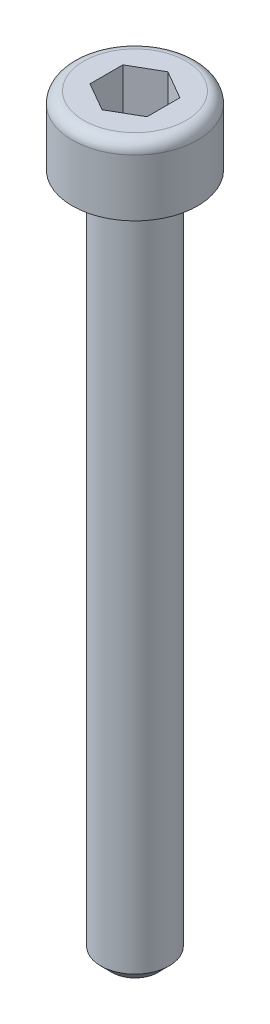
ISO-10303-21;
HEADER;
FILE_DESCRIPTION(('STEP AP214'),'2;1');
FILE_NAME('part.step','',(''),(''),'','','');
FILE_SCHEMA(('AUTOMOTIVE_DESIGN { 1 0 10303 214 1 1 1 1 }'));
ENDSEC;
DATA;
#1=APPLICATION_CONTEXT('core data for automotive mechanical design processes');
#2=APPLICATION_PROTOCOL_DEFINITION('international standard','automotive_design',2000,#1);
#3=PRODUCT_CONTEXT('',#1,'mechanical');
#4=PRODUCT('Part','Part','',(#3));
#5=PRODUCT_RELATED_PRODUCT_CATEGORY('part','',(#4));
#6=PRODUCT_DEFINITION_FORMATION('','',#4);
#7=PRODUCT_DEFINITION_CONTEXT('part definition',#1,'design');
#8=PRODUCT_DEFINITION('design','',#6,#7);
#9=PRODUCT_DEFINITION_SHAPE('','',#8);
#10=(LENGTH_UNIT() NAMED_UNIT(*) SI_UNIT(.MILLI.,.METRE.));
#11=(NAMED_UNIT(*) PLANE_ANGLE_UNIT() SI_UNIT($,.RADIAN.));
#12=(NAMED_UNIT(*) SI_UNIT($,.STERADIAN.) SOLID_ANGLE_UNIT());
#13=UNCERTAINTY_MEASURE_WITH_UNIT(LENGTH_MEASURE(1.E-05),#10,'distance_accuracy_value','');
#14=(GEOMETRIC_REPRESENTATION_CONTEXT(3) GLOBAL_UNCERTAINTY_ASSIGNED_CONTEXT((#13)) GLOBAL_UNIT_ASSIGNED_CONTEXT((#10,
#11,#12)) REPRESENTATION_CONTEXT('',''));
#15=CARTESIAN_POINT('',(0.,0.,0.));
#16=DIRECTION('',(0.,0.,1.));
#17=DIRECTION('',(1.,0.,0.));
#18=AXIS2_PLACEMENT_3D('',#15,#16,#17);
#19=CARTESIAN_POINT('',(0.,0.,0.));
#20=DIRECTION('',(0.,-1.,0.));
#21=DIRECTION('',(0.,0.,-1.));
#22=AXIS2_PLACEMENT_3D('',#19,#20,#21);
#23=PLANE('',#22);
#24=CARTESIAN_POINT('',(0.,0.,0.));
#25=DIRECTION('',(0.,-1.,0.));
#26=DIRECTION('',(0.,0.,-1.));
#27=AXIS2_PLACEMENT_3D('',#24,#25,#26);
#28=CIRCLE('',#27,2.25);
#29=CARTESIAN_POINT('',(0.,0.,-2.25));
#30=VERTEX_POINT('',#29);
#31=EDGE_CURVE('E42',#30,#30,#28,.F.);
#32=ORIENTED_EDGE('',*,*,#31,.T.);
#33=EDGE_LOOP('',(#32));
#34=FACE_BOUND('',#33,.T.);
#35=DIRECTION('',(-0.866025403784439,0.,-0.5));
#36=VECTOR('',#35,1.);
#37=CARTESIAN_POINT('',(1.25,0.,-0.721687836487032));
#38=LINE('',#37,#36);
#39=CARTESIAN_POINT('',(1.25,0.,-0.721687836487032));
#40=VERTEX_POINT('',#39);
#41=CARTESIAN_POINT('',(0.,0.,-1.44337567297406));
#42=VERTEX_POINT('',#41);
#43=EDGE_CURVE('E123',#40,#42,#38,.T.);
#44=ORIENTED_EDGE('',*,*,#43,.F.);
#45=DIRECTION('',(0.,0.,-1.));
#46=VECTOR('',#45,1.);
#47=CARTESIAN_POINT('',(1.25,0.,0.721687836487033));
#48=LINE('',#47,#46);
#49=CARTESIAN_POINT('',(1.25,0.,0.721687836487033));
#50=VERTEX_POINT('',#49);
#51=EDGE_CURVE('E49',#50,#40,#48,.T.);
#52=ORIENTED_EDGE('',*,*,#51,.F.);
#53=DIRECTION('',(0.866025403784439,0.,-0.5));
#54=VECTOR('',#53,1.);
#55=CARTESIAN_POINT('',(0.,0.,1.44337567297406));
#56=LINE('',#55,#54);
#57=CARTESIAN_POINT('',(0.,0.,1.44337567297406));
#58=VERTEX_POINT('',#57);
#59=EDGE_CURVE('E132',#58,#50,#56,.T.);
#60=ORIENTED_EDGE('',*,*,#59,.F.);
#61=DIRECTION('',(0.866025403784439,0.,0.5));
#62=VECTOR('',#61,1.);
#63=CARTESIAN_POINT('',(-1.25,0.,0.721687836487031));
#64=LINE('',#63,#62);
#65=CARTESIAN_POINT('',(-1.25,0.,0.721687836487031));
#66=VERTEX_POINT('',#65);
#67=EDGE_CURVE('E130',#66,#58,#64,.T.);
#68=ORIENTED_EDGE('',*,*,#67,.F.);
#69=DIRECTION('',(0.,0.,1.));
#70=VECTOR('',#69,1.);
#71=CARTESIAN_POINT('',(-1.25,0.,-0.721687836487033));
#72=LINE('',#71,#70);
#73=CARTESIAN_POINT('',(-1.25,0.,-0.721687836487033));
#74=VERTEX_POINT('',#73);
#75=EDGE_CURVE('E97',#74,#66,#72,.T.);
#76=ORIENTED_EDGE('',*,*,#75,.F.);
#77=DIRECTION('',(-0.866025403784439,0.,0.5));
#78=VECTOR('',#77,1.);
#79=CARTESIAN_POINT('',(0.,0.,-1.44337567297406));
#80=LINE('',#79,#78);
#81=EDGE_CURVE('E126',#42,#74,#80,.T.);
#82=ORIENTED_EDGE('',*,*,#81,.F.);
#83=EDGE_LOOP('',(#44,#52,#60,#68,#76,#82));
#84=FACE_BOUND('',#83,.T.);
#85=ADVANCED_FACE('F34',(#34,#84),#23,.F.);
#86=CARTESIAN_POINT('',(0.,0.,0.));
#87=DIRECTION('',(0.,1.,0.));
#88=DIRECTION('',(0.,0.,1.));
#89=AXIS2_PLACEMENT_3D('',#86,#87,#88);
#90=CYLINDRICAL_SURFACE('',#89,2.75);
#91=CARTESIAN_POINT('',(0.,-0.5,0.));
#92=DIRECTION('',(0.,-1.,0.));
#93=DIRECTION('',(0.,0.,-1.));
#94=AXIS2_PLACEMENT_3D('',#91,#92,#93);
#95=CIRCLE('',#94,2.75);
#96=CARTESIAN_POINT('',(0.,-0.5,-2.75));
#97=VERTEX_POINT('',#96);
#98=EDGE_CURVE('E11',#97,#97,#95,.T.);
#99=ORIENTED_EDGE('',*,*,#98,.T.);
#100=EDGE_LOOP('',(#99));
#101=FACE_BOUND('',#100,.T.);
#102=CARTESIAN_POINT('',(0.,-3.,0.));
#103=DIRECTION('',(0.,1.,0.));
#104=DIRECTION('',(0.,0.,1.));
#105=AXIS2_PLACEMENT_3D('',#102,#103,#104);
#106=CIRCLE('',#105,2.75);
#107=CARTESIAN_POINT('',(0.,-3.,2.75));
#108=VERTEX_POINT('',#107);
#109=EDGE_CURVE('E144',#108,#108,#106,.T.);
#110=ORIENTED_EDGE('',*,*,#109,.T.);
#111=EDGE_LOOP('',(#110));
#112=FACE_BOUND('',#111,.T.);
#113=ADVANCED_FACE('F166',(#101,#112),#90,.T.);
#114=CARTESIAN_POINT('',(2.75,-3.,0.));
#115=DIRECTION('',(0.,1.,0.));
#116=DIRECTION('',(0.,0.,1.));
#117=AXIS2_PLACEMENT_3D('',#114,#115,#116);
#118=PLANE('',#117);
#119=ORIENTED_EDGE('',*,*,#109,.F.);
#120=EDGE_LOOP('',(#119));
#121=FACE_BOUND('',#120,.T.);
#122=CARTESIAN_POINT('',(0.,-3.,0.));
#123=DIRECTION('',(0.,1.,0.));
#124=DIRECTION('',(0.,0.,1.));
#125=AXIS2_PLACEMENT_3D('',#122,#123,#124);
#126=CIRCLE('',#125,1.5);
#127=CARTESIAN_POINT('',(0.,-3.,1.5));
#128=VERTEX_POINT('',#127);
#129=EDGE_CURVE('E136',#128,#128,#126,.T.);
#130=ORIENTED_EDGE('',*,*,#129,.T.);
#131=EDGE_LOOP('',(#130));
#132=FACE_BOUND('',#131,.T.);
#133=ADVANCED_FACE('F171',(#121,#132),#118,.F.);
#134=CARTESIAN_POINT('',(0.,0.,0.));
#135=DIRECTION('',(0.,1.,0.));
#136=DIRECTION('',(0.,0.,1.));
#137=AXIS2_PLACEMENT_3D('',#134,#135,#136);
#138=CYLINDRICAL_SURFACE('',#137,1.5);
#139=CARTESIAN_POINT('',(0.,-32.5,0.));
#140=DIRECTION('',(0.,1.,0.));
#141=DIRECTION('',(0.,0.,1.));
#142=AXIS2_PLACEMENT_3D('',#139,#140,#141);
#143=CIRCLE('',#142,1.5);
#144=CARTESIAN_POINT('',(0.,-32.5,1.5));
#145=VERTEX_POINT('',#144);
#146=EDGE_CURVE('E147',#145,#145,#143,.T.);
#147=ORIENTED_EDGE('',*,*,#146,.T.);
#148=EDGE_LOOP('',(#147));
#149=FACE_BOUND('',#148,.T.);
#150=ORIENTED_EDGE('',*,*,#129,.F.);
#151=EDGE_LOOP('',(#150));
#152=FACE_BOUND('',#151,.T.);
#153=ADVANCED_FACE('F177',(#149,#152),#138,.T.);
#154=CARTESIAN_POINT('',(1.5,-33.,0.));
#155=DIRECTION('',(0.,1.,0.));
#156=DIRECTION('',(0.,0.,1.));
#157=AXIS2_PLACEMENT_3D('',#154,#155,#156);
#158=PLANE('',#157);
#159=CARTESIAN_POINT('',(0.,-33.,0.));
#160=DIRECTION('',(0.,1.,0.));
#161=DIRECTION('',(0.,0.,1.));
#162=AXIS2_PLACEMENT_3D('',#159,#160,#161);
#163=CIRCLE('',#162,1.);
#164=CARTESIAN_POINT('',(0.,-33.,1.));
#165=VERTEX_POINT('',#164);
#166=EDGE_CURVE('E150',#165,#165,#163,.F.);
#167=ORIENTED_EDGE('',*,*,#166,.T.);
#168=EDGE_LOOP('',(#167));
#169=FACE_BOUND('',#168,.T.);
#170=ADVANCED_FACE('F181',(#169),#158,.F.);
#171=CARTESIAN_POINT('',(1.25,-2.,0.721687836487033));
#172=DIRECTION('',(1.,0.,0.));
#173=DIRECTION('',(0.,0.,-1.));
#174=AXIS2_PLACEMENT_3D('',#171,#172,#173);
#175=PLANE('',#174);
#176=ORIENTED_EDGE('',*,*,#51,.T.);
#177=DIRECTION('',(0.,1.,0.));
#178=VECTOR('',#177,1.);
#179=CARTESIAN_POINT('',(1.25,-2.,-0.721687836487032));
#180=LINE('',#179,#178);
#181=CARTESIAN_POINT('',(1.25,-2.,-0.721687836487032));
#182=VERTEX_POINT('',#181);
#183=EDGE_CURVE('E79',#182,#40,#180,.T.);
#184=ORIENTED_EDGE('',*,*,#183,.F.);
#185=DIRECTION('',(0.,0.,-1.));
#186=VECTOR('',#185,1.);
#187=CARTESIAN_POINT('',(1.25,-2.,0.721687836487033));
#188=LINE('',#187,#186);
#189=CARTESIAN_POINT('',(1.25,-2.,0.721687836487033));
#190=VERTEX_POINT('',#189);
#191=EDGE_CURVE('E134',#190,#182,#188,.T.);
#192=ORIENTED_EDGE('',*,*,#191,.F.);
#193=DIRECTION('',(0.,1.,0.));
#194=VECTOR('',#193,1.);
#195=CARTESIAN_POINT('',(1.25,-2.,0.721687836487033));
#196=LINE('',#195,#194);
#197=EDGE_CURVE('E57',#190,#50,#196,.T.);
#198=ORIENTED_EDGE('',*,*,#197,.T.);
#199=EDGE_LOOP('',(#176,#184,#192,#198));
#200=FACE_BOUND('',#199,.T.);
#201=ADVANCED_FACE('F185',(#200),#175,.F.);
#202=CARTESIAN_POINT('',(0.,-2.,1.44337567297406));
#203=DIRECTION('',(0.5,0.,0.866025403784439));
#204=DIRECTION('',(0.866025403784439,0.,-0.5));
#205=AXIS2_PLACEMENT_3D('',#202,#203,#204);
#206=PLANE('',#205);
#207=ORIENTED_EDGE('',*,*,#59,.T.);
#208=ORIENTED_EDGE('',*,*,#197,.F.);
#209=DIRECTION('',(0.866025403784439,0.,-0.5));
#210=VECTOR('',#209,1.);
#211=CARTESIAN_POINT('',(0.,-2.,1.44337567297406));
#212=LINE('',#211,#210);
#213=CARTESIAN_POINT('',(0.,-2.,1.44337567297406));
#214=VERTEX_POINT('',#213);
#215=EDGE_CURVE('E109',#214,#190,#212,.T.);
#216=ORIENTED_EDGE('',*,*,#215,.F.);
#217=DIRECTION('',(0.,1.,0.));
#218=VECTOR('',#217,1.);
#219=CARTESIAN_POINT('',(0.,-2.,1.44337567297406));
#220=LINE('',#219,#218);
#221=EDGE_CURVE('E101',#214,#58,#220,.T.);
#222=ORIENTED_EDGE('',*,*,#221,.T.);
#223=EDGE_LOOP('',(#207,#208,#216,#222));
#224=FACE_BOUND('',#223,.T.);
#225=ADVANCED_FACE('F189',(#224),#206,.F.);
#226=CARTESIAN_POINT('',(-1.25,-2.,0.721687836487031));
#227=DIRECTION('',(-0.5,0.,0.866025403784439));
#228=DIRECTION('',(0.866025403784439,0.,0.5));
#229=AXIS2_PLACEMENT_3D('',#226,#227,#228);
#230=PLANE('',#229);
#231=ORIENTED_EDGE('',*,*,#67,.T.);
#232=ORIENTED_EDGE('',*,*,#221,.F.);
#233=DIRECTION('',(0.866025403784439,0.,0.5));
#234=VECTOR('',#233,1.);
#235=CARTESIAN_POINT('',(-1.25,-2.,0.721687836487031));
#236=LINE('',#235,#234);
#237=CARTESIAN_POINT('',(-1.25,-2.,0.721687836487031));
#238=VERTEX_POINT('',#237);
#239=EDGE_CURVE('E105',#238,#214,#236,.T.);
#240=ORIENTED_EDGE('',*,*,#239,.F.);
#241=DIRECTION('',(0.,1.,0.));
#242=VECTOR('',#241,1.);
#243=CARTESIAN_POINT('',(-1.25,-2.,0.721687836487031));
#244=LINE('',#243,#242);
#245=EDGE_CURVE('E90',#238,#66,#244,.T.);
#246=ORIENTED_EDGE('',*,*,#245,.T.);
#247=EDGE_LOOP('',(#231,#232,#240,#246));
#248=FACE_BOUND('',#247,.T.);
#249=ADVANCED_FACE('F106',(#248),#230,.F.);
#250=CARTESIAN_POINT('',(-1.25,-2.,-0.721687836487033));
#251=DIRECTION('',(-1.,0.,0.));
#252=DIRECTION('',(0.,0.,1.));
#253=AXIS2_PLACEMENT_3D('',#250,#251,#252);
#254=PLANE('',#253);
#255=ORIENTED_EDGE('',*,*,#75,.T.);
#256=ORIENTED_EDGE('',*,*,#245,.F.);
#257=DIRECTION('',(0.,0.,1.));
#258=VECTOR('',#257,1.);
#259=CARTESIAN_POINT('',(-1.25,-2.,-0.721687836487033));
#260=LINE('',#259,#258);
#261=CARTESIAN_POINT('',(-1.25,-2.,-0.721687836487033));
#262=VERTEX_POINT('',#261);
#263=EDGE_CURVE('E94',#262,#238,#260,.T.);
#264=ORIENTED_EDGE('',*,*,#263,.F.);
#265=DIRECTION('',(0.,1.,0.));
#266=VECTOR('',#265,1.);
#267=CARTESIAN_POINT('',(-1.25,-2.,-0.721687836487033));
#268=LINE('',#267,#266);
#269=EDGE_CURVE('E102',#262,#74,#268,.T.);
#270=ORIENTED_EDGE('',*,*,#269,.T.);
#271=EDGE_LOOP('',(#255,#256,#264,#270));
#272=FACE_BOUND('',#271,.T.);
#273=ADVANCED_FACE('F92',(#272),#254,.F.);
#274=CARTESIAN_POINT('',(0.,-2.,-1.44337567297406));
#275=DIRECTION('',(-0.5,0.,-0.866025403784439));
#276=DIRECTION('',(-0.866025403784439,0.,0.5));
#277=AXIS2_PLACEMENT_3D('',#274,#275,#276);
#278=PLANE('',#277);
#279=ORIENTED_EDGE('',*,*,#81,.T.);
#280=ORIENTED_EDGE('',*,*,#269,.F.);
#281=DIRECTION('',(-0.866025403784439,0.,0.5));
#282=VECTOR('',#281,1.);
#283=CARTESIAN_POINT('',(0.,-2.,-1.44337567297406));
#284=LINE('',#283,#282);
#285=CARTESIAN_POINT('',(0.,-2.,-1.44337567297406));
#286=VERTEX_POINT('',#285);
#287=EDGE_CURVE('E115',#286,#262,#284,.T.);
#288=ORIENTED_EDGE('',*,*,#287,.F.);
#289=DIRECTION('',(0.,1.,0.));
#290=VECTOR('',#289,1.);
#291=CARTESIAN_POINT('',(0.,-2.,-1.44337567297406));
#292=LINE('',#291,#290);
#293=EDGE_CURVE('E139',#286,#42,#292,.T.);
#294=ORIENTED_EDGE('',*,*,#293,.T.);
#295=EDGE_LOOP('',(#279,#280,#288,#294));
#296=FACE_BOUND('',#295,.T.);
#297=ADVANCED_FACE('F193',(#296),#278,.F.);
#298=CARTESIAN_POINT('',(1.25,-2.,-0.721687836487032));
#299=DIRECTION('',(0.5,0.,-0.866025403784439));
#300=DIRECTION('',(-0.866025403784439,0.,-0.5));
#301=AXIS2_PLACEMENT_3D('',#298,#299,#300);
#302=PLANE('',#301);
#303=ORIENTED_EDGE('',*,*,#43,.T.);
#304=ORIENTED_EDGE('',*,*,#293,.F.);
#305=DIRECTION('',(-0.866025403784439,0.,-0.5));
#306=VECTOR('',#305,1.);
#307=CARTESIAN_POINT('',(1.25,-2.,-0.721687836487032));
#308=LINE('',#307,#306);
#309=EDGE_CURVE('E117',#182,#286,#308,.T.);
#310=ORIENTED_EDGE('',*,*,#309,.F.);
#311=ORIENTED_EDGE('',*,*,#183,.T.);
#312=EDGE_LOOP('',(#303,#304,#310,#311));
#313=FACE_BOUND('',#312,.T.);
#314=ADVANCED_FACE('F190',(#313),#302,.F.);
#315=CARTESIAN_POINT('',(1.25,-2.,-0.721687836487032));
#316=DIRECTION('',(0.,1.,0.));
#317=DIRECTION('',(0.,0.,1.));
#318=AXIS2_PLACEMENT_3D('',#315,#316,#317);
#319=PLANE('',#318);
#320=ORIENTED_EDGE('',*,*,#191,.T.);
#321=ORIENTED_EDGE('',*,*,#309,.T.);
#322=ORIENTED_EDGE('',*,*,#287,.T.);
#323=ORIENTED_EDGE('',*,*,#263,.T.);
#324=ORIENTED_EDGE('',*,*,#239,.T.);
#325=ORIENTED_EDGE('',*,*,#215,.T.);
#326=EDGE_LOOP('',(#320,#321,#322,#323,#324,#325));
#327=FACE_BOUND('',#326,.T.);
#328=ADVANCED_FACE('F112',(#327),#319,.T.);
#329=CARTESIAN_POINT('',(0.,-32.5,0.));
#330=DIRECTION('',(0.,1.,0.));
#331=DIRECTION('',(0.,0.,1.));
#332=AXIS2_PLACEMENT_3D('',#329,#330,#331);
#333=CONICAL_SURFACE('',#332,1.5,0.785398163397446);
#334=ORIENTED_EDGE('',*,*,#166,.F.);
#335=EDGE_LOOP('',(#334));
#336=FACE_BOUND('',#335,.T.);
#337=ORIENTED_EDGE('',*,*,#146,.F.);
#338=EDGE_LOOP('',(#337));
#339=FACE_BOUND('',#338,.T.);
#340=ADVANCED_FACE('F158',(#336,#339),#333,.T.);
#341=CARTESIAN_POINT('',(0.,-0.5,0.));
#342=DIRECTION('',(0.,-1.,0.));
#343=DIRECTION('',(0.,0.,-1.));
#344=AXIS2_PLACEMENT_3D('',#341,#342,#343);
#345=TOROIDAL_SURFACE('',#344,2.25,0.5);
#346=ORIENTED_EDGE('',*,*,#98,.F.);
#347=EDGE_LOOP('',(#346));
#348=FACE_BOUND('',#347,.T.);
#349=ORIENTED_EDGE('',*,*,#31,.F.);
#350=EDGE_LOOP('',(#349));
#351=FACE_BOUND('',#350,.T.);
#352=ADVANCED_FACE('F36',(#348,#351),#345,.T.);
#353=CLOSED_SHELL('',(#85,#113,#133,#153,#170,#201,#225,#249,#273,#297,#314,#328,#340,#352));
#354=MANIFOLD_SOLID_BREP('B2',#353);
#355=ADVANCED_BREP_SHAPE_REPRESENTATION('',(#18,#354),#14);
#356=SHAPE_DEFINITION_REPRESENTATION(#9,#355);
ENDSEC;
END-ISO-10303-21;
